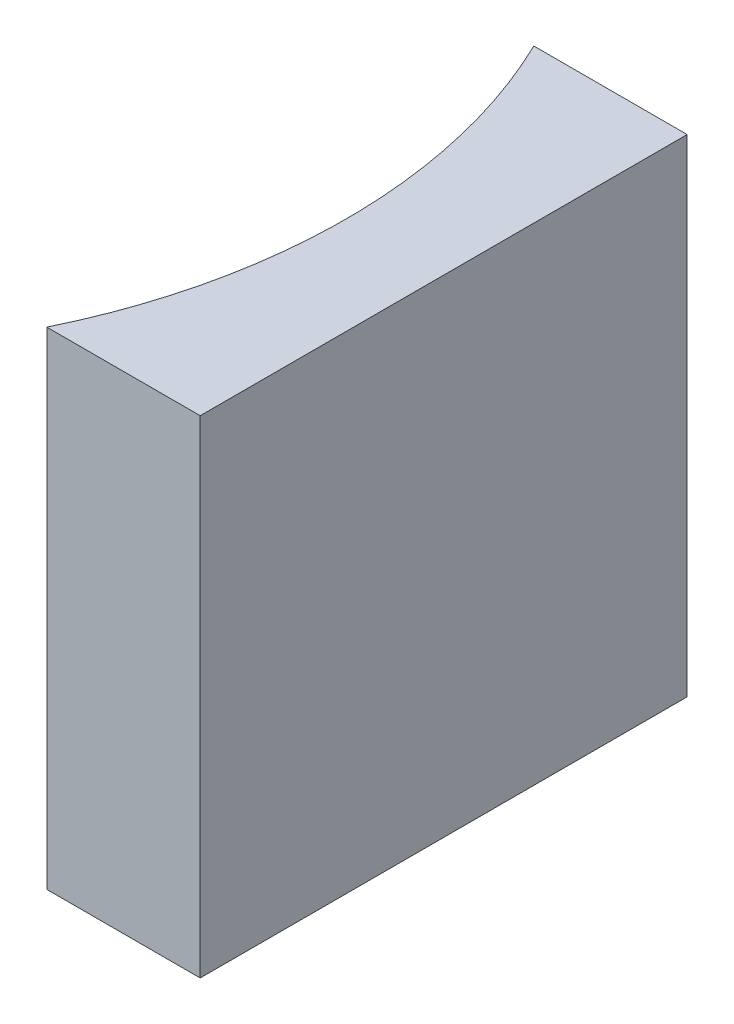
ISO-10303-21;
HEADER;
FILE_DESCRIPTION(('STEP AP214'),'2;1');
FILE_NAME('part.step','',(''),(''),'','','');
FILE_SCHEMA(('AUTOMOTIVE_DESIGN { 1 0 10303 214 1 1 1 1 }'));
ENDSEC;
DATA;
#1=APPLICATION_CONTEXT('core data for automotive mechanical design processes');
#2=APPLICATION_PROTOCOL_DEFINITION('international standard','automotive_design',2000,#1);
#3=PRODUCT_CONTEXT('',#1,'mechanical');
#4=PRODUCT('Part','Part','',(#3));
#5=PRODUCT_RELATED_PRODUCT_CATEGORY('part','',(#4));
#6=PRODUCT_DEFINITION_FORMATION('','',#4);
#7=PRODUCT_DEFINITION_CONTEXT('part definition',#1,'design');
#8=PRODUCT_DEFINITION('design','',#6,#7);
#9=PRODUCT_DEFINITION_SHAPE('','',#8);
#10=(LENGTH_UNIT() NAMED_UNIT(*) SI_UNIT(.MILLI.,.METRE.));
#11=(NAMED_UNIT(*) PLANE_ANGLE_UNIT() SI_UNIT($,.RADIAN.));
#12=(NAMED_UNIT(*) SI_UNIT($,.STERADIAN.) SOLID_ANGLE_UNIT());
#13=UNCERTAINTY_MEASURE_WITH_UNIT(LENGTH_MEASURE(1.E-05),#10,'distance_accuracy_value','');
#14=(GEOMETRIC_REPRESENTATION_CONTEXT(3) GLOBAL_UNCERTAINTY_ASSIGNED_CONTEXT((#13)) GLOBAL_UNIT_ASSIGNED_CONTEXT((#10,
#11,#12)) REPRESENTATION_CONTEXT('',''));
#15=CARTESIAN_POINT('',(0.,0.,0.));
#16=DIRECTION('',(0.,0.,1.));
#17=DIRECTION('',(1.,0.,0.));
#18=AXIS2_PLACEMENT_3D('',#15,#16,#17);
#19=CARTESIAN_POINT('',(0.,10.,0.));
#20=DIRECTION('',(0.,0.,1.));
#21=DIRECTION('',(1.,0.,0.));
#22=AXIS2_PLACEMENT_3D('',#19,#20,#21);
#23=PLANE('',#22);
#24=DIRECTION('',(-1.,0.,0.));
#25=VECTOR('',#24,1.);
#26=CARTESIAN_POINT('',(0.,0.,0.));
#27=LINE('',#26,#25);
#28=CARTESIAN_POINT('',(0.,0.,0.));
#29=VERTEX_POINT('',#28);
#30=CARTESIAN_POINT('',(-3.1493932217563,0.,0.));
#31=VERTEX_POINT('',#30);
#32=EDGE_CURVE('E98',#29,#31,#27,.T.);
#33=ORIENTED_EDGE('',*,*,#32,.T.);
#34=DIRECTION('',(0.,-1.,0.));
#35=VECTOR('',#34,1.);
#36=CARTESIAN_POINT('',(-3.1493932217563,10.,0.));
#37=LINE('',#36,#35);
#38=CARTESIAN_POINT('',(-3.1493932217563,10.,0.));
#39=VERTEX_POINT('',#38);
#40=EDGE_CURVE('E11',#39,#31,#37,.T.);
#41=ORIENTED_EDGE('',*,*,#40,.F.);
#42=DIRECTION('',(-1.,0.,0.));
#43=VECTOR('',#42,1.);
#44=CARTESIAN_POINT('',(0.,10.,0.));
#45=LINE('',#44,#43);
#46=CARTESIAN_POINT('',(0.,10.,0.));
#47=VERTEX_POINT('',#46);
#48=EDGE_CURVE('E86',#47,#39,#45,.T.);
#49=ORIENTED_EDGE('',*,*,#48,.F.);
#50=DIRECTION('',(0.,-1.,0.));
#51=VECTOR('',#50,1.);
#52=CARTESIAN_POINT('',(0.,10.,0.));
#53=LINE('',#52,#51);
#54=EDGE_CURVE('E94',#47,#29,#53,.T.);
#55=ORIENTED_EDGE('',*,*,#54,.T.);
#56=EDGE_LOOP('',(#33,#41,#49,#55));
#57=FACE_BOUND('',#56,.T.);
#58=ADVANCED_FACE('F35',(#57),#23,.F.);
#59=CARTESIAN_POINT('',(-13.45,10.,5.));
#60=DIRECTION('',(0.,-1.,0.));
#61=DIRECTION('',(0.,0.,-1.));
#62=AXIS2_PLACEMENT_3D('',#59,#60,#61);
#63=CYLINDRICAL_SURFACE('',#62,11.45);
#64=CARTESIAN_POINT('',(-13.45,0.,5.));
#65=DIRECTION('',(0.,-1.,0.));
#66=DIRECTION('',(0.,0.,1.));
#67=AXIS2_PLACEMENT_3D('',#64,#65,#66);
#68=CIRCLE('',#67,11.45);
#69=CARTESIAN_POINT('',(-3.1493932217563,0.,10.));
#70=VERTEX_POINT('',#69);
#71=EDGE_CURVE('E90',#31,#70,#68,.T.);
#72=ORIENTED_EDGE('',*,*,#71,.T.);
#73=DIRECTION('',(0.,-1.,0.));
#74=VECTOR('',#73,1.);
#75=CARTESIAN_POINT('',(-3.1493932217563,10.,10.));
#76=LINE('',#75,#74);
#77=CARTESIAN_POINT('',(-3.1493932217563,10.,10.));
#78=VERTEX_POINT('',#77);
#79=EDGE_CURVE('E43',#78,#70,#76,.T.);
#80=ORIENTED_EDGE('',*,*,#79,.F.);
#81=CARTESIAN_POINT('',(-13.45,10.,5.));
#82=DIRECTION('',(0.,-1.,0.));
#83=DIRECTION('',(0.,0.,1.));
#84=AXIS2_PLACEMENT_3D('',#81,#82,#83);
#85=CIRCLE('',#84,11.45);
#86=EDGE_CURVE('E81',#39,#78,#85,.T.);
#87=ORIENTED_EDGE('',*,*,#86,.F.);
#88=ORIENTED_EDGE('',*,*,#40,.T.);
#89=EDGE_LOOP('',(#72,#80,#87,#88));
#90=FACE_BOUND('',#89,.T.);
#91=ADVANCED_FACE('F89',(#90),#63,.F.);
#92=CARTESIAN_POINT('',(0.,10.,10.));
#93=DIRECTION('',(0.,0.,-1.));
#94=DIRECTION('',(-1.,0.,0.));
#95=AXIS2_PLACEMENT_3D('',#92,#93,#94);
#96=PLANE('',#95);
#97=DIRECTION('',(1.,0.,0.));
#98=VECTOR('',#97,1.);
#99=CARTESIAN_POINT('',(0.,0.,10.));
#100=LINE('',#99,#98);
#101=CARTESIAN_POINT('',(0.,0.,10.));
#102=VERTEX_POINT('',#101);
#103=EDGE_CURVE('E68',#70,#102,#100,.T.);
#104=ORIENTED_EDGE('',*,*,#103,.T.);
#105=DIRECTION('',(0.,-1.,0.));
#106=VECTOR('',#105,1.);
#107=CARTESIAN_POINT('',(0.,10.,10.));
#108=LINE('',#107,#106);
#109=CARTESIAN_POINT('',(0.,10.,10.));
#110=VERTEX_POINT('',#109);
#111=EDGE_CURVE('E91',#110,#102,#108,.T.);
#112=ORIENTED_EDGE('',*,*,#111,.F.);
#113=DIRECTION('',(1.,0.,0.));
#114=VECTOR('',#113,1.);
#115=CARTESIAN_POINT('',(0.,10.,10.));
#116=LINE('',#115,#114);
#117=EDGE_CURVE('E84',#78,#110,#116,.T.);
#118=ORIENTED_EDGE('',*,*,#117,.F.);
#119=ORIENTED_EDGE('',*,*,#79,.T.);
#120=EDGE_LOOP('',(#104,#112,#118,#119));
#121=FACE_BOUND('',#120,.T.);
#122=ADVANCED_FACE('F92',(#121),#96,.F.);
#123=CARTESIAN_POINT('',(0.,10.,0.));
#124=DIRECTION('',(-1.,0.,0.));
#125=DIRECTION('',(0.,0.,1.));
#126=AXIS2_PLACEMENT_3D('',#123,#124,#125);
#127=PLANE('',#126);
#128=DIRECTION('',(0.,0.,-1.));
#129=VECTOR('',#128,1.);
#130=CARTESIAN_POINT('',(0.,0.,0.));
#131=LINE('',#130,#129);
#132=EDGE_CURVE('E74',#102,#29,#131,.T.);
#133=ORIENTED_EDGE('',*,*,#132,.T.);
#134=ORIENTED_EDGE('',*,*,#54,.F.);
#135=DIRECTION('',(0.,0.,-1.));
#136=VECTOR('',#135,1.);
#137=CARTESIAN_POINT('',(0.,10.,0.));
#138=LINE('',#137,#136);
#139=EDGE_CURVE('E51',#110,#47,#138,.T.);
#140=ORIENTED_EDGE('',*,*,#139,.F.);
#141=ORIENTED_EDGE('',*,*,#111,.T.);
#142=EDGE_LOOP('',(#133,#134,#140,#141));
#143=FACE_BOUND('',#142,.T.);
#144=ADVANCED_FACE('F105',(#143),#127,.F.);
#145=CARTESIAN_POINT('',(-13.45,10.,5.));
#146=DIRECTION('',(0.,1.,0.));
#147=DIRECTION('',(0.,0.,1.));
#148=AXIS2_PLACEMENT_3D('',#145,#146,#147);
#149=PLANE('',#148);
#150=ORIENTED_EDGE('',*,*,#48,.T.);
#151=ORIENTED_EDGE('',*,*,#86,.T.);
#152=ORIENTED_EDGE('',*,*,#117,.T.);
#153=ORIENTED_EDGE('',*,*,#139,.T.);
#154=EDGE_LOOP('',(#150,#151,#152,#153));
#155=FACE_BOUND('',#154,.T.);
#156=ADVANCED_FACE('F82',(#155),#149,.T.);
#157=CARTESIAN_POINT('',(-13.45,0.,5.));
#158=DIRECTION('',(0.,1.,0.));
#159=DIRECTION('',(0.,0.,1.));
#160=AXIS2_PLACEMENT_3D('',#157,#158,#159);
#161=PLANE('',#160);
#162=ORIENTED_EDGE('',*,*,#32,.F.);
#163=ORIENTED_EDGE('',*,*,#132,.F.);
#164=ORIENTED_EDGE('',*,*,#103,.F.);
#165=ORIENTED_EDGE('',*,*,#71,.F.);
#166=EDGE_LOOP('',(#162,#163,#164,#165));
#167=FACE_BOUND('',#166,.T.);
#168=ADVANCED_FACE('F108',(#167),#161,.F.);
#169=CLOSED_SHELL('',(#58,#91,#122,#144,#156,#168));
#170=MANIFOLD_SOLID_BREP('B2',#169);
#171=ADVANCED_BREP_SHAPE_REPRESENTATION('',(#18,#170),#14);
#172=SHAPE_DEFINITION_REPRESENTATION(#9,#171);
ENDSEC;
END-ISO-10303-21;
